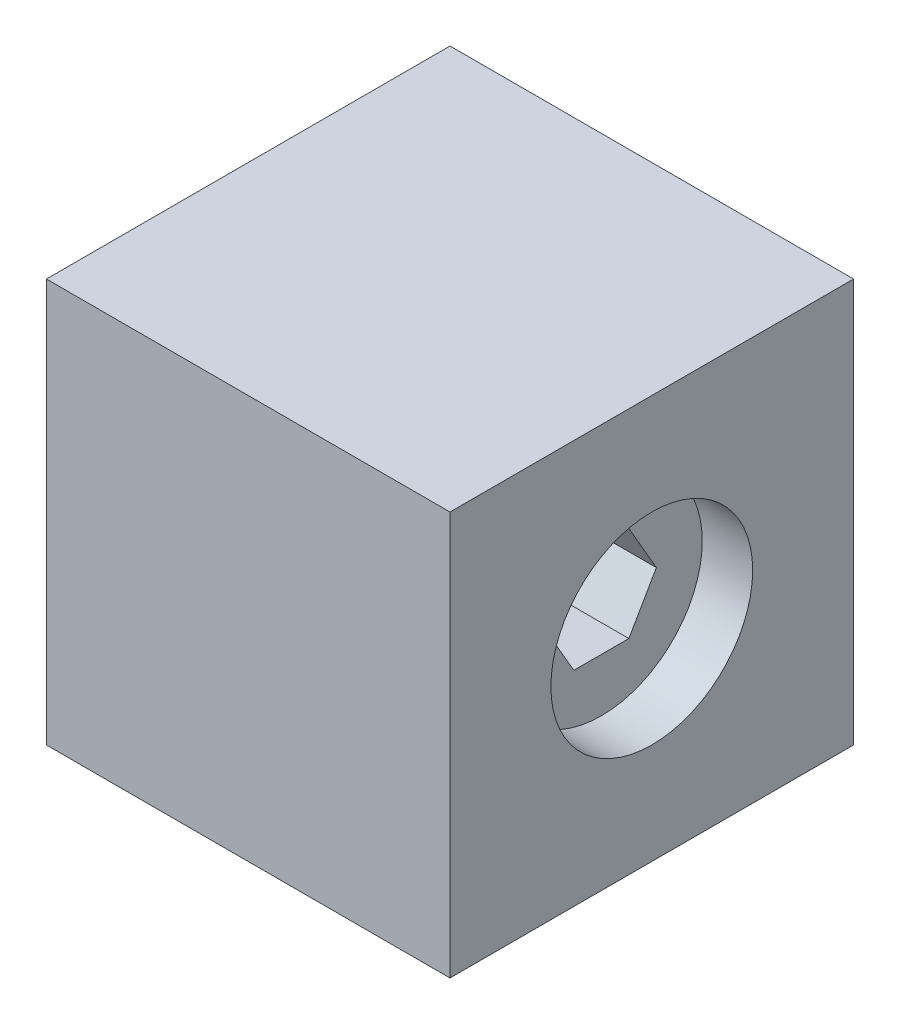
ISO-10303-21;
HEADER;
FILE_DESCRIPTION(('STEP AP214'),'2;1');
FILE_NAME('part.step','',(''),(''),'','','');
FILE_SCHEMA(('AUTOMOTIVE_DESIGN { 1 0 10303 214 1 1 1 1 }'));
ENDSEC;
DATA;
#1=APPLICATION_CONTEXT('core data for automotive mechanical design processes');
#2=APPLICATION_PROTOCOL_DEFINITION('international standard','automotive_design',2000,#1);
#3=PRODUCT_CONTEXT('',#1,'mechanical');
#4=PRODUCT('Part','Part','',(#3));
#5=PRODUCT_RELATED_PRODUCT_CATEGORY('part','',(#4));
#6=PRODUCT_DEFINITION_FORMATION('','',#4);
#7=PRODUCT_DEFINITION_CONTEXT('part definition',#1,'design');
#8=PRODUCT_DEFINITION('design','',#6,#7);
#9=PRODUCT_DEFINITION_SHAPE('','',#8);
#10=(LENGTH_UNIT() NAMED_UNIT(*) SI_UNIT(.MILLI.,.METRE.));
#11=(NAMED_UNIT(*) PLANE_ANGLE_UNIT() SI_UNIT($,.RADIAN.));
#12=(NAMED_UNIT(*) SI_UNIT($,.STERADIAN.) SOLID_ANGLE_UNIT());
#13=UNCERTAINTY_MEASURE_WITH_UNIT(LENGTH_MEASURE(1.E-05),#10,'distance_accuracy_value','');
#14=(GEOMETRIC_REPRESENTATION_CONTEXT(3) GLOBAL_UNCERTAINTY_ASSIGNED_CONTEXT((#13)) GLOBAL_UNIT_ASSIGNED_CONTEXT((#10,
#11,#12)) REPRESENTATION_CONTEXT('',''));
#15=CARTESIAN_POINT('',(0.,0.,0.));
#16=DIRECTION('',(0.,0.,1.));
#17=DIRECTION('',(1.,0.,0.));
#18=AXIS2_PLACEMENT_3D('',#15,#16,#17);
#19=CARTESIAN_POINT('',(-25.4,19.4,-3.46410161513776));
#20=DIRECTION('',(0.,-0.5,-0.866025403784438));
#21=DIRECTION('',(0.,0.866025403784439,-0.5));
#22=AXIS2_PLACEMENT_3D('',#19,#20,#21);
#23=PLANE('',#22);
#24=DIRECTION('',(0.,-0.866025403784439,0.5));
#25=VECTOR('',#24,1.);
#26=CARTESIAN_POINT('',(19.05,19.4,-3.46410161513776));
#27=LINE('',#26,#25);
#28=CARTESIAN_POINT('',(19.05,25.4,-6.92820323027552));
#29=VERTEX_POINT('',#28);
#30=CARTESIAN_POINT('',(19.05,19.4,-3.46410161513776));
#31=VERTEX_POINT('',#30);
#32=EDGE_CURVE('E158',#29,#31,#27,.T.);
#33=ORIENTED_EDGE('',*,*,#32,.F.);
#34=DIRECTION('',(1.,0.,0.));
#35=VECTOR('',#34,1.);
#36=CARTESIAN_POINT('',(-25.4,25.4,-6.92820323027552));
#37=LINE('',#36,#35);
#38=CARTESIAN_POINT('',(-25.4,25.4,-6.92820323027552));
#39=VERTEX_POINT('',#38);
#40=EDGE_CURVE('E165',#39,#29,#37,.T.);
#41=ORIENTED_EDGE('',*,*,#40,.F.);
#42=DIRECTION('',(0.,0.866025403784438,-0.5));
#43=VECTOR('',#42,1.);
#44=CARTESIAN_POINT('',(-25.4,19.4,-3.46410161513776));
#45=LINE('',#44,#43);
#46=CARTESIAN_POINT('',(-25.4,19.4,-3.46410161513776));
#47=VERTEX_POINT('',#46);
#48=EDGE_CURVE('E168',#47,#39,#45,.T.);
#49=ORIENTED_EDGE('',*,*,#48,.F.);
#50=DIRECTION('',(1.,0.,0.));
#51=VECTOR('',#50,1.);
#52=CARTESIAN_POINT('',(-25.4,19.4,-3.46410161513776));
#53=LINE('',#52,#51);
#54=EDGE_CURVE('E167',#47,#31,#53,.T.);
#55=ORIENTED_EDGE('',*,*,#54,.T.);
#56=EDGE_LOOP('',(#33,#41,#49,#55));
#57=FACE_BOUND('',#56,.T.);
#58=ADVANCED_FACE('F34',(#57),#23,.F.);
#59=CARTESIAN_POINT('',(-25.4,19.4,3.46410161513776));
#60=DIRECTION('',(0.,-1.,0.));
#61=DIRECTION('',(0.,0.,-1.));
#62=AXIS2_PLACEMENT_3D('',#59,#60,#61);
#63=PLANE('',#62);
#64=DIRECTION('',(0.,0.,1.));
#65=VECTOR('',#64,1.);
#66=CARTESIAN_POINT('',(19.05,19.4,3.46410161513776));
#67=LINE('',#66,#65);
#68=CARTESIAN_POINT('',(19.05,19.4,3.46410161513776));
#69=VERTEX_POINT('',#68);
#70=EDGE_CURVE('E169',#31,#69,#67,.T.);
#71=ORIENTED_EDGE('',*,*,#70,.F.);
#72=ORIENTED_EDGE('',*,*,#54,.F.);
#73=DIRECTION('',(0.,0.,-1.));
#74=VECTOR('',#73,1.);
#75=CARTESIAN_POINT('',(-25.4,19.4,3.46410161513776));
#76=LINE('',#75,#74);
#77=CARTESIAN_POINT('',(-25.4,19.4,3.46410161513776));
#78=VERTEX_POINT('',#77);
#79=EDGE_CURVE('E176',#78,#47,#76,.T.);
#80=ORIENTED_EDGE('',*,*,#79,.F.);
#81=DIRECTION('',(1.,0.,0.));
#82=VECTOR('',#81,1.);
#83=CARTESIAN_POINT('',(-25.4,19.4,3.46410161513776));
#84=LINE('',#83,#82);
#85=EDGE_CURVE('E513',#78,#69,#84,.T.);
#86=ORIENTED_EDGE('',*,*,#85,.T.);
#87=EDGE_LOOP('',(#71,#72,#80,#86));
#88=FACE_BOUND('',#87,.T.);
#89=ADVANCED_FACE('F311',(#88),#63,.F.);
#90=CARTESIAN_POINT('',(-25.4,25.4,6.92820323027552));
#91=DIRECTION('',(0.,-0.5,0.866025403784439));
#92=DIRECTION('',(0.,-0.866025403784439,-0.5));
#93=AXIS2_PLACEMENT_3D('',#90,#91,#92);
#94=PLANE('',#93);
#95=DIRECTION('',(0.,0.866025403784439,0.5));
#96=VECTOR('',#95,1.);
#97=CARTESIAN_POINT('',(19.05,25.4,6.92820323027552));
#98=LINE('',#97,#96);
#99=CARTESIAN_POINT('',(19.05,25.4,6.92820323027552));
#100=VERTEX_POINT('',#99);
#101=EDGE_CURVE('E501',#69,#100,#98,.T.);
#102=ORIENTED_EDGE('',*,*,#101,.F.);
#103=ORIENTED_EDGE('',*,*,#85,.F.);
#104=DIRECTION('',(0.,-0.866025403784439,-0.5));
#105=VECTOR('',#104,1.);
#106=CARTESIAN_POINT('',(-25.4,25.4,6.92820323027552));
#107=LINE('',#106,#105);
#108=CARTESIAN_POINT('',(-25.4,25.4,6.92820323027552));
#109=VERTEX_POINT('',#108);
#110=EDGE_CURVE('E181',#109,#78,#107,.T.);
#111=ORIENTED_EDGE('',*,*,#110,.F.);
#112=DIRECTION('',(1.,0.,0.));
#113=VECTOR('',#112,1.);
#114=CARTESIAN_POINT('',(-25.4,25.4,6.92820323027552));
#115=LINE('',#114,#113);
#116=EDGE_CURVE('E516',#109,#100,#115,.T.);
#117=ORIENTED_EDGE('',*,*,#116,.T.);
#118=EDGE_LOOP('',(#102,#103,#111,#117));
#119=FACE_BOUND('',#118,.T.);
#120=ADVANCED_FACE('F317',(#119),#94,.F.);
#121=CARTESIAN_POINT('',(-25.4,31.4,3.46410161513776));
#122=DIRECTION('',(0.,0.5,0.866025403784439));
#123=DIRECTION('',(0.,-0.866025403784439,0.5));
#124=AXIS2_PLACEMENT_3D('',#121,#122,#123);
#125=PLANE('',#124);
#126=DIRECTION('',(0.,0.866025403784439,-0.5));
#127=VECTOR('',#126,1.);
#128=CARTESIAN_POINT('',(19.05,31.4,3.46410161513776));
#129=LINE('',#128,#127);
#130=CARTESIAN_POINT('',(19.05,31.4,3.46410161513776));
#131=VERTEX_POINT('',#130);
#132=EDGE_CURVE('E499',#100,#131,#129,.T.);
#133=ORIENTED_EDGE('',*,*,#132,.F.);
#134=ORIENTED_EDGE('',*,*,#116,.F.);
#135=DIRECTION('',(0.,-0.866025403784439,0.5));
#136=VECTOR('',#135,1.);
#137=CARTESIAN_POINT('',(-25.4,31.4,3.46410161513776));
#138=LINE('',#137,#136);
#139=CARTESIAN_POINT('',(-25.4,31.4,3.46410161513776));
#140=VERTEX_POINT('',#139);
#141=EDGE_CURVE('E507',#140,#109,#138,.T.);
#142=ORIENTED_EDGE('',*,*,#141,.F.);
#143=DIRECTION('',(1.,0.,0.));
#144=VECTOR('',#143,1.);
#145=CARTESIAN_POINT('',(-25.4,31.4,3.46410161513776));
#146=LINE('',#145,#144);
#147=EDGE_CURVE('E178',#140,#131,#146,.T.);
#148=ORIENTED_EDGE('',*,*,#147,.T.);
#149=EDGE_LOOP('',(#133,#134,#142,#148));
#150=FACE_BOUND('',#149,.T.);
#151=ADVANCED_FACE('F435',(#150),#125,.F.);
#152=CARTESIAN_POINT('',(-25.4,31.4,-3.46410161513777));
#153=DIRECTION('',(0.,1.,0.));
#154=DIRECTION('',(0.,0.,1.));
#155=AXIS2_PLACEMENT_3D('',#152,#153,#154);
#156=PLANE('',#155);
#157=DIRECTION('',(0.,0.,-1.));
#158=VECTOR('',#157,1.);
#159=CARTESIAN_POINT('',(19.05,31.4,-3.46410161513777));
#160=LINE('',#159,#158);
#161=CARTESIAN_POINT('',(19.05,31.4,-3.46410161513777));
#162=VERTEX_POINT('',#161);
#163=EDGE_CURVE('E48',#131,#162,#160,.T.);
#164=ORIENTED_EDGE('',*,*,#163,.F.);
#165=ORIENTED_EDGE('',*,*,#147,.F.);
#166=DIRECTION('',(0.,0.,1.));
#167=VECTOR('',#166,1.);
#168=CARTESIAN_POINT('',(-25.4,31.4,-3.46410161513777));
#169=LINE('',#168,#167);
#170=CARTESIAN_POINT('',(-25.4,31.4,-3.46410161513776));
#171=VERTEX_POINT('',#170);
#172=EDGE_CURVE('E56',#171,#140,#169,.T.);
#173=ORIENTED_EDGE('',*,*,#172,.F.);
#174=DIRECTION('',(1.,0.,0.));
#175=VECTOR('',#174,1.);
#176=CARTESIAN_POINT('',(-25.4,31.4,-3.46410161513777));
#177=LINE('',#176,#175);
#178=EDGE_CURVE('E175',#171,#162,#177,.T.);
#179=ORIENTED_EDGE('',*,*,#178,.T.);
#180=EDGE_LOOP('',(#164,#165,#173,#179));
#181=FACE_BOUND('',#180,.T.);
#182=ADVANCED_FACE('F445',(#181),#156,.F.);
#183=CARTESIAN_POINT('',(-25.4,25.4,-6.92820323027552));
#184=DIRECTION('',(0.,0.5,-0.866025403784439));
#185=DIRECTION('',(0.,0.866025403784439,0.5));
#186=AXIS2_PLACEMENT_3D('',#183,#184,#185);
#187=PLANE('',#186);
#188=DIRECTION('',(0.,-0.866025403784439,-0.5));
#189=VECTOR('',#188,1.);
#190=CARTESIAN_POINT('',(19.05,25.4,-6.92820323027552));
#191=LINE('',#190,#189);
#192=EDGE_CURVE('E11',#162,#29,#191,.T.);
#193=ORIENTED_EDGE('',*,*,#192,.F.);
#194=ORIENTED_EDGE('',*,*,#178,.F.);
#195=DIRECTION('',(0.,0.866025403784439,0.5));
#196=VECTOR('',#195,1.);
#197=CARTESIAN_POINT('',(-25.4,25.4,-6.92820323027552));
#198=LINE('',#197,#196);
#199=EDGE_CURVE('E173',#39,#171,#198,.T.);
#200=ORIENTED_EDGE('',*,*,#199,.F.);
#201=ORIENTED_EDGE('',*,*,#40,.T.);
#202=EDGE_LOOP('',(#193,#194,#200,#201));
#203=FACE_BOUND('',#202,.T.);
#204=ADVANCED_FACE('F171',(#203),#187,.F.);
#205=CARTESIAN_POINT('',(25.4,50.8,25.4));
#206=DIRECTION('',(-1.,0.,0.));
#207=DIRECTION('',(0.,0.,1.));
#208=AXIS2_PLACEMENT_3D('',#205,#206,#207);
#209=PLANE('',#208);
#210=CARTESIAN_POINT('',(25.4,25.4,0.));
#211=DIRECTION('',(1.,0.,0.));
#212=DIRECTION('',(0.,0.,-1.));
#213=AXIS2_PLACEMENT_3D('',#210,#211,#212);
#214=CIRCLE('',#213,12.7);
#215=CARTESIAN_POINT('',(25.4,25.4,-12.7));
#216=VERTEX_POINT('',#215);
#217=EDGE_CURVE('E494',#216,#216,#214,.T.);
#218=ORIENTED_EDGE('',*,*,#217,.F.);
#219=EDGE_LOOP('',(#218));
#220=FACE_BOUND('',#219,.T.);
#221=DIRECTION('',(0.,0.,-1.));
#222=VECTOR('',#221,1.);
#223=CARTESIAN_POINT('',(25.4,0.,25.4));
#224=LINE('',#223,#222);
#225=CARTESIAN_POINT('',(25.4,0.,25.4));
#226=VERTEX_POINT('',#225);
#227=CARTESIAN_POINT('',(25.4,0.,-25.4));
#228=VERTEX_POINT('',#227);
#229=EDGE_CURVE('E244',#226,#228,#224,.T.);
#230=ORIENTED_EDGE('',*,*,#229,.T.);
#231=DIRECTION('',(0.,-1.,0.));
#232=VECTOR('',#231,1.);
#233=CARTESIAN_POINT('',(25.4,50.8,-25.4));
#234=LINE('',#233,#232);
#235=CARTESIAN_POINT('',(25.4,50.8,-25.4));
#236=VERTEX_POINT('',#235);
#237=EDGE_CURVE('E42',#236,#228,#234,.T.);
#238=ORIENTED_EDGE('',*,*,#237,.F.);
#239=DIRECTION('',(0.,0.,-1.));
#240=VECTOR('',#239,1.);
#241=CARTESIAN_POINT('',(25.4,50.8,25.4));
#242=LINE('',#241,#240);
#243=CARTESIAN_POINT('',(25.4,50.8,25.4));
#244=VERTEX_POINT('',#243);
#245=EDGE_CURVE('E251',#244,#236,#242,.T.);
#246=ORIENTED_EDGE('',*,*,#245,.F.);
#247=DIRECTION('',(0.,-1.,0.));
#248=VECTOR('',#247,1.);
#249=CARTESIAN_POINT('',(25.4,50.8,25.4));
#250=LINE('',#249,#248);
#251=EDGE_CURVE('E261',#244,#226,#250,.T.);
#252=ORIENTED_EDGE('',*,*,#251,.T.);
#253=EDGE_LOOP('',(#230,#238,#246,#252));
#254=FACE_BOUND('',#253,.T.);
#255=ADVANCED_FACE('F36',(#220,#254),#209,.F.);
#256=CARTESIAN_POINT('',(-25.4,50.8,-25.4));
#257=DIRECTION('',(0.,0.,1.));
#258=DIRECTION('',(1.,0.,0.));
#259=AXIS2_PLACEMENT_3D('',#256,#257,#258);
#260=PLANE('',#259);
#261=DIRECTION('',(-1.,0.,0.));
#262=VECTOR('',#261,1.);
#263=CARTESIAN_POINT('',(-25.4,0.,-25.4));
#264=LINE('',#263,#262);
#265=CARTESIAN_POINT('',(-25.4,0.,-25.4));
#266=VERTEX_POINT('',#265);
#267=EDGE_CURVE('E264',#228,#266,#264,.T.);
#268=ORIENTED_EDGE('',*,*,#267,.T.);
#269=DIRECTION('',(0.,-1.,0.));
#270=VECTOR('',#269,1.);
#271=CARTESIAN_POINT('',(-25.4,50.8,-25.4));
#272=LINE('',#271,#270);
#273=CARTESIAN_POINT('',(-25.4,50.8,-25.4));
#274=VERTEX_POINT('',#273);
#275=EDGE_CURVE('E274',#274,#266,#272,.T.);
#276=ORIENTED_EDGE('',*,*,#275,.F.);
#277=DIRECTION('',(-1.,0.,0.));
#278=VECTOR('',#277,1.);
#279=CARTESIAN_POINT('',(-25.4,50.8,-25.4));
#280=LINE('',#279,#278);
#281=EDGE_CURVE('E254',#236,#274,#280,.T.);
#282=ORIENTED_EDGE('',*,*,#281,.F.);
#283=ORIENTED_EDGE('',*,*,#237,.T.);
#284=EDGE_LOOP('',(#268,#276,#282,#283));
#285=FACE_BOUND('',#284,.T.);
#286=ADVANCED_FACE('F279',(#285),#260,.F.);
#287=CARTESIAN_POINT('',(-25.4,50.8,25.4));
#288=DIRECTION('',(1.,0.,0.));
#289=DIRECTION('',(0.,0.,-1.));
#290=AXIS2_PLACEMENT_3D('',#287,#288,#289);
#291=PLANE('',#290);
#292=ORIENTED_EDGE('',*,*,#79,.T.);
#293=ORIENTED_EDGE('',*,*,#48,.T.);
#294=ORIENTED_EDGE('',*,*,#199,.T.);
#295=ORIENTED_EDGE('',*,*,#172,.T.);
#296=ORIENTED_EDGE('',*,*,#141,.T.);
#297=ORIENTED_EDGE('',*,*,#110,.T.);
#298=EDGE_LOOP('',(#292,#293,#294,#295,#296,#297));
#299=FACE_BOUND('',#298,.T.);
#300=DIRECTION('',(0.,0.,1.));
#301=VECTOR('',#300,1.);
#302=CARTESIAN_POINT('',(-25.4,0.,25.4));
#303=LINE('',#302,#301);
#304=CARTESIAN_POINT('',(-25.4,0.,25.4));
#305=VERTEX_POINT('',#304);
#306=EDGE_CURVE('E266',#266,#305,#303,.T.);
#307=ORIENTED_EDGE('',*,*,#306,.T.);
#308=DIRECTION('',(0.,-1.,0.));
#309=VECTOR('',#308,1.);
#310=CARTESIAN_POINT('',(-25.4,50.8,25.4));
#311=LINE('',#310,#309);
#312=CARTESIAN_POINT('',(-25.4,50.8,25.4));
#313=VERTEX_POINT('',#312);
#314=EDGE_CURVE('E271',#313,#305,#311,.T.);
#315=ORIENTED_EDGE('',*,*,#314,.F.);
#316=DIRECTION('',(0.,0.,1.));
#317=VECTOR('',#316,1.);
#318=CARTESIAN_POINT('',(-25.4,50.8,25.4));
#319=LINE('',#318,#317);
#320=EDGE_CURVE('E257',#274,#313,#319,.T.);
#321=ORIENTED_EDGE('',*,*,#320,.F.);
#322=ORIENTED_EDGE('',*,*,#275,.T.);
#323=EDGE_LOOP('',(#307,#315,#321,#322));
#324=FACE_BOUND('',#323,.T.);
#325=ADVANCED_FACE('F291',(#299,#324),#291,.F.);
#326=CARTESIAN_POINT('',(-25.4,50.8,25.4));
#327=DIRECTION('',(0.,0.,-1.));
#328=DIRECTION('',(-1.,0.,0.));
#329=AXIS2_PLACEMENT_3D('',#326,#327,#328);
#330=PLANE('',#329);
#331=DIRECTION('',(1.,0.,0.));
#332=VECTOR('',#331,1.);
#333=CARTESIAN_POINT('',(-25.4,0.,25.4));
#334=LINE('',#333,#332);
#335=EDGE_CURVE('E255',#305,#226,#334,.T.);
#336=ORIENTED_EDGE('',*,*,#335,.T.);
#337=ORIENTED_EDGE('',*,*,#251,.F.);
#338=DIRECTION('',(1.,0.,0.));
#339=VECTOR('',#338,1.);
#340=CARTESIAN_POINT('',(-25.4,50.8,25.4));
#341=LINE('',#340,#339);
#342=EDGE_CURVE('E259',#313,#244,#341,.T.);
#343=ORIENTED_EDGE('',*,*,#342,.F.);
#344=ORIENTED_EDGE('',*,*,#314,.T.);
#345=EDGE_LOOP('',(#336,#337,#343,#344));
#346=FACE_BOUND('',#345,.T.);
#347=ADVANCED_FACE('F295',(#346),#330,.F.);
#348=CARTESIAN_POINT('',(0.,50.8,0.));
#349=DIRECTION('',(0.,-1.,0.));
#350=DIRECTION('',(0.,0.,-1.));
#351=AXIS2_PLACEMENT_3D('',#348,#349,#350);
#352=PLANE('',#351);
#353=ORIENTED_EDGE('',*,*,#245,.T.);
#354=ORIENTED_EDGE('',*,*,#281,.T.);
#355=ORIENTED_EDGE('',*,*,#320,.T.);
#356=ORIENTED_EDGE('',*,*,#342,.T.);
#357=EDGE_LOOP('',(#353,#354,#355,#356));
#358=FACE_BOUND('',#357,.T.);
#359=ADVANCED_FACE('F297',(#358),#352,.F.);
#360=CARTESIAN_POINT('',(0.,0.,0.));
#361=DIRECTION('',(0.,-1.,0.));
#362=DIRECTION('',(0.,0.,-1.));
#363=AXIS2_PLACEMENT_3D('',#360,#361,#362);
#364=PLANE('',#363);
#365=DIRECTION('',(0.,0.,1.));
#366=VECTOR('',#365,1.);
#367=CARTESIAN_POINT('',(12.7,0.,12.7));
#368=LINE('',#367,#366);
#369=CARTESIAN_POINT('',(12.7,0.,-12.7));
#370=VERTEX_POINT('',#369);
#371=CARTESIAN_POINT('',(12.7,0.,12.7));
#372=VERTEX_POINT('',#371);
#373=EDGE_CURVE('E212',#370,#372,#368,.T.);
#374=ORIENTED_EDGE('',*,*,#373,.F.);
#375=DIRECTION('',(1.,0.,0.));
#376=VECTOR('',#375,1.);
#377=CARTESIAN_POINT('',(-12.7,0.,-12.7));
#378=LINE('',#377,#376);
#379=CARTESIAN_POINT('',(-12.7,0.,-12.7));
#380=VERTEX_POINT('',#379);
#381=EDGE_CURVE('E223',#380,#370,#378,.T.);
#382=ORIENTED_EDGE('',*,*,#381,.F.);
#383=DIRECTION('',(0.,0.,-1.));
#384=VECTOR('',#383,1.);
#385=CARTESIAN_POINT('',(-12.7,0.,12.7));
#386=LINE('',#385,#384);
#387=CARTESIAN_POINT('',(-12.7,0.,12.7));
#388=VERTEX_POINT('',#387);
#389=EDGE_CURVE('E237',#388,#380,#386,.T.);
#390=ORIENTED_EDGE('',*,*,#389,.F.);
#391=DIRECTION('',(-1.,0.,0.));
#392=VECTOR('',#391,1.);
#393=CARTESIAN_POINT('',(-12.7,0.,12.7));
#394=LINE('',#393,#392);
#395=EDGE_CURVE('E234',#372,#388,#394,.T.);
#396=ORIENTED_EDGE('',*,*,#395,.F.);
#397=EDGE_LOOP('',(#374,#382,#390,#396));
#398=FACE_BOUND('',#397,.T.);
#399=ORIENTED_EDGE('',*,*,#229,.F.);
#400=ORIENTED_EDGE('',*,*,#335,.F.);
#401=ORIENTED_EDGE('',*,*,#306,.F.);
#402=ORIENTED_EDGE('',*,*,#267,.F.);
#403=EDGE_LOOP('',(#399,#400,#401,#402));
#404=FACE_BOUND('',#403,.T.);
#405=ADVANCED_FACE('F287',(#398,#404),#364,.T.);
#406=CARTESIAN_POINT('',(12.7,15.24,12.7));
#407=DIRECTION('',(1.,0.,0.));
#408=DIRECTION('',(0.,0.,-1.));
#409=AXIS2_PLACEMENT_3D('',#406,#407,#408);
#410=PLANE('',#409);
#411=ORIENTED_EDGE('',*,*,#373,.T.);
#412=DIRECTION('',(0.,-1.,0.));
#413=VECTOR('',#412,1.);
#414=CARTESIAN_POINT('',(12.7,15.24,12.7));
#415=LINE('',#414,#413);
#416=CARTESIAN_POINT('',(12.7,15.24,12.7));
#417=VERTEX_POINT('',#416);
#418=EDGE_CURVE('E232',#417,#372,#415,.T.);
#419=ORIENTED_EDGE('',*,*,#418,.F.);
#420=DIRECTION('',(0.,0.,1.));
#421=VECTOR('',#420,1.);
#422=CARTESIAN_POINT('',(12.7,15.24,12.7));
#423=LINE('',#422,#421);
#424=CARTESIAN_POINT('',(12.7,15.24,-12.7));
#425=VERTEX_POINT('',#424);
#426=EDGE_CURVE('E219',#425,#417,#423,.T.);
#427=ORIENTED_EDGE('',*,*,#426,.F.);
#428=DIRECTION('',(0.,-1.,0.));
#429=VECTOR('',#428,1.);
#430=CARTESIAN_POINT('',(12.7,15.24,-12.7));
#431=LINE('',#430,#429);
#432=EDGE_CURVE('E242',#425,#370,#431,.T.);
#433=ORIENTED_EDGE('',*,*,#432,.T.);
#434=EDGE_LOOP('',(#411,#419,#427,#433));
#435=FACE_BOUND('',#434,.T.);
#436=ADVANCED_FACE('F304',(#435),#410,.F.);
#437=CARTESIAN_POINT('',(-12.7,15.24,-12.7));
#438=DIRECTION('',(0.,0.,-1.));
#439=DIRECTION('',(-1.,0.,0.));
#440=AXIS2_PLACEMENT_3D('',#437,#438,#439);
#441=PLANE('',#440);
#442=ORIENTED_EDGE('',*,*,#381,.T.);
#443=ORIENTED_EDGE('',*,*,#432,.F.);
#444=DIRECTION('',(1.,0.,0.));
#445=VECTOR('',#444,1.);
#446=CARTESIAN_POINT('',(-12.7,15.24,-12.7));
#447=LINE('',#446,#445);
#448=CARTESIAN_POINT('',(-12.7,15.24,-12.7));
#449=VERTEX_POINT('',#448);
#450=EDGE_CURVE('E229',#449,#425,#447,.T.);
#451=ORIENTED_EDGE('',*,*,#450,.F.);
#452=DIRECTION('',(0.,-1.,0.));
#453=VECTOR('',#452,1.);
#454=CARTESIAN_POINT('',(-12.7,15.24,-12.7));
#455=LINE('',#454,#453);
#456=EDGE_CURVE('E245',#449,#380,#455,.T.);
#457=ORIENTED_EDGE('',*,*,#456,.T.);
#458=EDGE_LOOP('',(#442,#443,#451,#457));
#459=FACE_BOUND('',#458,.T.);
#460=ADVANCED_FACE('F344',(#459),#441,.F.);
#461=CARTESIAN_POINT('',(-12.7,15.24,12.7));
#462=DIRECTION('',(-1.,0.,0.));
#463=DIRECTION('',(0.,0.,1.));
#464=AXIS2_PLACEMENT_3D('',#461,#462,#463);
#465=PLANE('',#464);
#466=ORIENTED_EDGE('',*,*,#389,.T.);
#467=ORIENTED_EDGE('',*,*,#456,.F.);
#468=DIRECTION('',(0.,0.,-1.));
#469=VECTOR('',#468,1.);
#470=CARTESIAN_POINT('',(-12.7,15.24,12.7));
#471=LINE('',#470,#469);
#472=CARTESIAN_POINT('',(-12.7,15.24,12.7));
#473=VERTEX_POINT('',#472);
#474=EDGE_CURVE('E226',#473,#449,#471,.T.);
#475=ORIENTED_EDGE('',*,*,#474,.F.);
#476=DIRECTION('',(0.,-1.,0.));
#477=VECTOR('',#476,1.);
#478=CARTESIAN_POINT('',(-12.7,15.24,12.7));
#479=LINE('',#478,#477);
#480=EDGE_CURVE('E247',#473,#388,#479,.T.);
#481=ORIENTED_EDGE('',*,*,#480,.T.);
#482=EDGE_LOOP('',(#466,#467,#475,#481));
#483=FACE_BOUND('',#482,.T.);
#484=ADVANCED_FACE('F347',(#483),#465,.F.);
#485=CARTESIAN_POINT('',(-12.7,15.24,12.7));
#486=DIRECTION('',(0.,0.,1.));
#487=DIRECTION('',(1.,0.,0.));
#488=AXIS2_PLACEMENT_3D('',#485,#486,#487);
#489=PLANE('',#488);
#490=ORIENTED_EDGE('',*,*,#395,.T.);
#491=ORIENTED_EDGE('',*,*,#480,.F.);
#492=DIRECTION('',(-1.,0.,0.));
#493=VECTOR('',#492,1.);
#494=CARTESIAN_POINT('',(-12.7,15.24,12.7));
#495=LINE('',#494,#493);
#496=EDGE_CURVE('E222',#417,#473,#495,.T.);
#497=ORIENTED_EDGE('',*,*,#496,.F.);
#498=ORIENTED_EDGE('',*,*,#418,.T.);
#499=EDGE_LOOP('',(#490,#491,#497,#498));
#500=FACE_BOUND('',#499,.T.);
#501=ADVANCED_FACE('F342',(#500),#489,.F.);
#502=CARTESIAN_POINT('',(0.,15.24,0.));
#503=DIRECTION('',(0.,-1.,0.));
#504=DIRECTION('',(0.,0.,-1.));
#505=AXIS2_PLACEMENT_3D('',#502,#503,#504);
#506=PLANE('',#505);
#507=DIRECTION('',(1.,0.,0.));
#508=VECTOR('',#507,1.);
#509=CARTESIAN_POINT('',(-11.176,15.24,-11.176));
#510=LINE('',#509,#508);
#511=CARTESIAN_POINT('',(-11.176,15.24,-11.176));
#512=VERTEX_POINT('',#511);
#513=CARTESIAN_POINT('',(11.176,15.24,-11.176));
#514=VERTEX_POINT('',#513);
#515=EDGE_CURVE('E195',#512,#514,#510,.T.);
#516=ORIENTED_EDGE('',*,*,#515,.F.);
#517=DIRECTION('',(0.,0.,-1.));
#518=VECTOR('',#517,1.);
#519=CARTESIAN_POINT('',(-11.176,15.24,11.176));
#520=LINE('',#519,#518);
#521=CARTESIAN_POINT('',(-11.176,15.24,11.176));
#522=VERTEX_POINT('',#521);
#523=EDGE_CURVE('E192',#522,#512,#520,.T.);
#524=ORIENTED_EDGE('',*,*,#523,.F.);
#525=DIRECTION('',(-1.,0.,0.));
#526=VECTOR('',#525,1.);
#527=CARTESIAN_POINT('',(-11.176,15.24,11.176));
#528=LINE('',#527,#526);
#529=CARTESIAN_POINT('',(11.176,15.24,11.176));
#530=VERTEX_POINT('',#529);
#531=EDGE_CURVE('E188',#530,#522,#528,.T.);
#532=ORIENTED_EDGE('',*,*,#531,.F.);
#533=DIRECTION('',(0.,0.,1.));
#534=VECTOR('',#533,1.);
#535=CARTESIAN_POINT('',(11.176,15.24,11.176));
#536=LINE('',#535,#534);
#537=EDGE_CURVE('E185',#514,#530,#536,.T.);
#538=ORIENTED_EDGE('',*,*,#537,.F.);
#539=EDGE_LOOP('',(#516,#524,#532,#538));
#540=FACE_BOUND('',#539,.T.);
#541=ORIENTED_EDGE('',*,*,#426,.T.);
#542=ORIENTED_EDGE('',*,*,#496,.T.);
#543=ORIENTED_EDGE('',*,*,#474,.T.);
#544=ORIENTED_EDGE('',*,*,#450,.T.);
#545=EDGE_LOOP('',(#541,#542,#543,#544));
#546=FACE_BOUND('',#545,.T.);
#547=ADVANCED_FACE('F338',(#540,#546),#506,.T.);
#548=CARTESIAN_POINT('',(11.176,15.24,11.176));
#549=DIRECTION('',(1.,0.,0.));
#550=DIRECTION('',(0.,0.,-1.));
#551=AXIS2_PLACEMENT_3D('',#548,#549,#550);
#552=PLANE('',#551);
#553=DIRECTION('',(0.,0.,1.));
#554=VECTOR('',#553,1.);
#555=CARTESIAN_POINT('',(11.176,0.,11.176));
#556=LINE('',#555,#554);
#557=CARTESIAN_POINT('',(11.176,0.,-11.176));
#558=VERTEX_POINT('',#557);
#559=CARTESIAN_POINT('',(11.176,0.,11.176));
#560=VERTEX_POINT('',#559);
#561=EDGE_CURVE('E199',#558,#560,#556,.T.);
#562=ORIENTED_EDGE('',*,*,#561,.F.);
#563=DIRECTION('',(0.,-1.,0.));
#564=VECTOR('',#563,1.);
#565=CARTESIAN_POINT('',(11.176,15.24,-11.176));
#566=LINE('',#565,#564);
#567=EDGE_CURVE('E210',#514,#558,#566,.T.);
#568=ORIENTED_EDGE('',*,*,#567,.F.);
#569=ORIENTED_EDGE('',*,*,#537,.T.);
#570=DIRECTION('',(0.,-1.,0.));
#571=VECTOR('',#570,1.);
#572=CARTESIAN_POINT('',(11.176,15.24,11.176));
#573=LINE('',#572,#571);
#574=EDGE_CURVE('E198',#530,#560,#573,.T.);
#575=ORIENTED_EDGE('',*,*,#574,.T.);
#576=EDGE_LOOP('',(#562,#568,#569,#575));
#577=FACE_BOUND('',#576,.T.);
#578=ADVANCED_FACE('F327',(#577),#552,.T.);
#579=CARTESIAN_POINT('',(-11.176,15.24,-11.176));
#580=DIRECTION('',(0.,0.,-1.));
#581=DIRECTION('',(-1.,0.,0.));
#582=AXIS2_PLACEMENT_3D('',#579,#580,#581);
#583=PLANE('',#582);
#584=DIRECTION('',(1.,0.,0.));
#585=VECTOR('',#584,1.);
#586=CARTESIAN_POINT('',(-11.176,0.,-11.176));
#587=LINE('',#586,#585);
#588=CARTESIAN_POINT('',(-11.176,0.,-11.176));
#589=VERTEX_POINT('',#588);
#590=EDGE_CURVE('E189',#589,#558,#587,.T.);
#591=ORIENTED_EDGE('',*,*,#590,.F.);
#592=DIRECTION('',(0.,-1.,0.));
#593=VECTOR('',#592,1.);
#594=CARTESIAN_POINT('',(-11.176,15.24,-11.176));
#595=LINE('',#594,#593);
#596=EDGE_CURVE('E213',#512,#589,#595,.T.);
#597=ORIENTED_EDGE('',*,*,#596,.F.);
#598=ORIENTED_EDGE('',*,*,#515,.T.);
#599=ORIENTED_EDGE('',*,*,#567,.T.);
#600=EDGE_LOOP('',(#591,#597,#598,#599));
#601=FACE_BOUND('',#600,.T.);
#602=ADVANCED_FACE('F323',(#601),#583,.T.);
#603=CARTESIAN_POINT('',(-11.176,15.24,11.176));
#604=DIRECTION('',(-1.,0.,0.));
#605=DIRECTION('',(0.,0.,1.));
#606=AXIS2_PLACEMENT_3D('',#603,#604,#605);
#607=PLANE('',#606);
#608=DIRECTION('',(0.,0.,-1.));
#609=VECTOR('',#608,1.);
#610=CARTESIAN_POINT('',(-11.176,0.,11.176));
#611=LINE('',#610,#609);
#612=CARTESIAN_POINT('',(-11.176,0.,11.176));
#613=VERTEX_POINT('',#612);
#614=EDGE_CURVE('E205',#613,#589,#611,.T.);
#615=ORIENTED_EDGE('',*,*,#614,.F.);
#616=DIRECTION('',(0.,-1.,0.));
#617=VECTOR('',#616,1.);
#618=CARTESIAN_POINT('',(-11.176,15.24,11.176));
#619=LINE('',#618,#617);
#620=EDGE_CURVE('E215',#522,#613,#619,.T.);
#621=ORIENTED_EDGE('',*,*,#620,.F.);
#622=ORIENTED_EDGE('',*,*,#523,.T.);
#623=ORIENTED_EDGE('',*,*,#596,.T.);
#624=EDGE_LOOP('',(#615,#621,#622,#623));
#625=FACE_BOUND('',#624,.T.);
#626=ADVANCED_FACE('F326',(#625),#607,.T.);
#627=CARTESIAN_POINT('',(-11.176,15.24,11.176));
#628=DIRECTION('',(0.,0.,1.));
#629=DIRECTION('',(1.,0.,0.));
#630=AXIS2_PLACEMENT_3D('',#627,#628,#629);
#631=PLANE('',#630);
#632=DIRECTION('',(-1.,0.,0.));
#633=VECTOR('',#632,1.);
#634=CARTESIAN_POINT('',(-11.176,0.,11.176));
#635=LINE('',#634,#633);
#636=EDGE_CURVE('E202',#560,#613,#635,.T.);
#637=ORIENTED_EDGE('',*,*,#636,.F.);
#638=ORIENTED_EDGE('',*,*,#574,.F.);
#639=ORIENTED_EDGE('',*,*,#531,.T.);
#640=ORIENTED_EDGE('',*,*,#620,.T.);
#641=EDGE_LOOP('',(#637,#638,#639,#640));
#642=FACE_BOUND('',#641,.T.);
#643=ADVANCED_FACE('F331',(#642),#631,.T.);
#644=ORIENTED_EDGE('',*,*,#590,.T.);
#645=ORIENTED_EDGE('',*,*,#561,.T.);
#646=ORIENTED_EDGE('',*,*,#636,.T.);
#647=ORIENTED_EDGE('',*,*,#614,.T.);
#648=EDGE_LOOP('',(#644,#645,#646,#647));
#649=FACE_BOUND('',#648,.T.);
#650=ADVANCED_FACE('F307',(#649),#364,.T.);
#651=CARTESIAN_POINT('',(19.05,25.4,0.));
#652=DIRECTION('',(1.,0.,0.));
#653=DIRECTION('',(0.,0.,-1.));
#654=AXIS2_PLACEMENT_3D('',#651,#652,#653);
#655=PLANE('',#654);
#656=CARTESIAN_POINT('',(19.05,25.4,0.));
#657=DIRECTION('',(1.,0.,0.));
#658=DIRECTION('',(0.,0.,-1.));
#659=AXIS2_PLACEMENT_3D('',#656,#657,#658);
#660=CIRCLE('',#659,12.7);
#661=CARTESIAN_POINT('',(19.05,25.4,-12.7));
#662=VERTEX_POINT('',#661);
#663=EDGE_CURVE('E491',#662,#662,#660,.T.);
#664=ORIENTED_EDGE('',*,*,#663,.T.);
#665=EDGE_LOOP('',(#664));
#666=FACE_BOUND('',#665,.T.);
#667=ORIENTED_EDGE('',*,*,#32,.T.);
#668=ORIENTED_EDGE('',*,*,#70,.T.);
#669=ORIENTED_EDGE('',*,*,#101,.T.);
#670=ORIENTED_EDGE('',*,*,#132,.T.);
#671=ORIENTED_EDGE('',*,*,#163,.T.);
#672=ORIENTED_EDGE('',*,*,#192,.T.);
#673=EDGE_LOOP('',(#667,#668,#669,#670,#671,#672));
#674=FACE_BOUND('',#673,.T.);
#675=ADVANCED_FACE('F157',(#666,#674),#655,.T.);
#676=CARTESIAN_POINT('',(19.05,25.4,0.));
#677=DIRECTION('',(1.,0.,0.));
#678=DIRECTION('',(0.,0.,-1.));
#679=AXIS2_PLACEMENT_3D('',#676,#677,#678);
#680=CYLINDRICAL_SURFACE('',#679,12.7);
#681=ORIENTED_EDGE('',*,*,#663,.F.);
#682=EDGE_LOOP('',(#681));
#683=FACE_BOUND('',#682,.T.);
#684=ORIENTED_EDGE('',*,*,#217,.T.);
#685=EDGE_LOOP('',(#684));
#686=FACE_BOUND('',#685,.T.);
#687=ADVANCED_FACE('F474',(#683,#686),#680,.F.);
#688=CLOSED_SHELL('',(#58,#89,#120,#151,#182,#204,#255,#286,#325,#347,#359,#405,#436,#460,#484,
#501,#547,#578,#602,#626,#643,#650,#675,#687));
#689=MANIFOLD_SOLID_BREP('B2',#688);
#690=ADVANCED_BREP_SHAPE_REPRESENTATION('',(#18,#689),#14);
#691=SHAPE_DEFINITION_REPRESENTATION(#9,#690);
ENDSEC;
END-ISO-10303-21;
